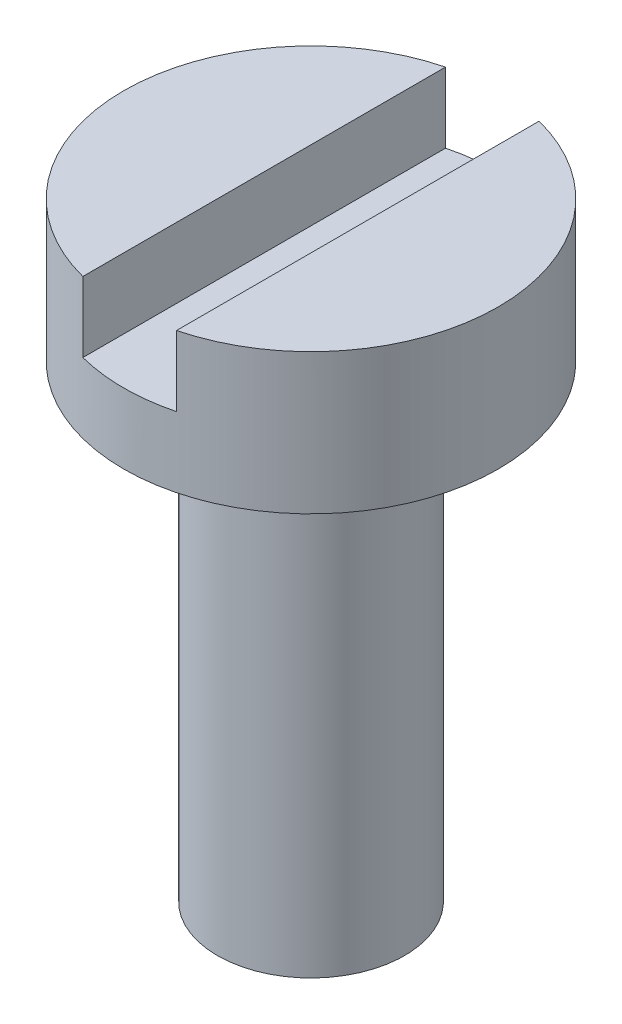
ISO-10303-21;
HEADER;
FILE_DESCRIPTION(('STEP AP214'),'2;1');
FILE_NAME('part.step','',(''),(''),'','','');
FILE_SCHEMA(('AUTOMOTIVE_DESIGN { 1 0 10303 214 1 1 1 1 }'));
ENDSEC;
DATA;
#1=APPLICATION_CONTEXT('core data for automotive mechanical design processes');
#2=APPLICATION_PROTOCOL_DEFINITION('international standard','automotive_design',2000,#1);
#3=PRODUCT_CONTEXT('',#1,'mechanical');
#4=PRODUCT('Part','Part','',(#3));
#5=PRODUCT_RELATED_PRODUCT_CATEGORY('part','',(#4));
#6=PRODUCT_DEFINITION_FORMATION('','',#4);
#7=PRODUCT_DEFINITION_CONTEXT('part definition',#1,'design');
#8=PRODUCT_DEFINITION('design','',#6,#7);
#9=PRODUCT_DEFINITION_SHAPE('','',#8);
#10=(LENGTH_UNIT() NAMED_UNIT(*) SI_UNIT(.MILLI.,.METRE.));
#11=(NAMED_UNIT(*) PLANE_ANGLE_UNIT() SI_UNIT($,.RADIAN.));
#12=(NAMED_UNIT(*) SI_UNIT($,.STERADIAN.) SOLID_ANGLE_UNIT());
#13=UNCERTAINTY_MEASURE_WITH_UNIT(LENGTH_MEASURE(1.E-05),#10,'distance_accuracy_value','');
#14=(GEOMETRIC_REPRESENTATION_CONTEXT(3) GLOBAL_UNCERTAINTY_ASSIGNED_CONTEXT((#13)) GLOBAL_UNIT_ASSIGNED_CONTEXT((#10,
#11,#12)) REPRESENTATION_CONTEXT('',''));
#15=CARTESIAN_POINT('',(0.,0.,0.));
#16=DIRECTION('',(0.,0.,1.));
#17=DIRECTION('',(1.,0.,0.));
#18=AXIS2_PLACEMENT_3D('',#15,#16,#17);
#19=CARTESIAN_POINT('',(0.,0.,0.));
#20=DIRECTION('',(0.,1.,0.));
#21=DIRECTION('',(0.,0.,1.));
#22=AXIS2_PLACEMENT_3D('',#19,#20,#21);
#23=PLANE('',#22);
#24=CARTESIAN_POINT('',(0.,0.,0.));
#25=DIRECTION('',(0.,1.,0.));
#26=DIRECTION('',(0.,0.,1.));
#27=AXIS2_PLACEMENT_3D('',#24,#25,#26);
#28=CIRCLE('',#27,4.);
#29=CARTESIAN_POINT('',(0.,0.,4.));
#30=VERTEX_POINT('',#29);
#31=EDGE_CURVE('E93',#30,#30,#28,.T.);
#32=ORIENTED_EDGE('',*,*,#31,.F.);
#33=EDGE_LOOP('',(#32));
#34=FACE_BOUND('',#33,.T.);
#35=CARTESIAN_POINT('',(0.,0.,0.));
#36=DIRECTION('',(0.,1.,0.));
#37=DIRECTION('',(0.,0.,1.));
#38=AXIS2_PLACEMENT_3D('',#35,#36,#37);
#39=CIRCLE('',#38,2.);
#40=CARTESIAN_POINT('',(0.,0.,2.));
#41=VERTEX_POINT('',#40);
#42=EDGE_CURVE('E11',#41,#41,#39,.F.);
#43=ORIENTED_EDGE('',*,*,#42,.F.);
#44=EDGE_LOOP('',(#43));
#45=FACE_BOUND('',#44,.T.);
#46=ADVANCED_FACE('F32',(#34,#45),#23,.F.);
#47=CARTESIAN_POINT('',(0.,3.,0.));
#48=DIRECTION('',(0.,1.,0.));
#49=DIRECTION('',(0.,0.,1.));
#50=AXIS2_PLACEMENT_3D('',#47,#48,#49);
#51=PLANE('',#50);
#52=DIRECTION('',(0.,0.,-1.));
#53=VECTOR('',#52,1.);
#54=CARTESIAN_POINT('',(1.,3.,0.));
#55=LINE('',#54,#53);
#56=CARTESIAN_POINT('',(1.,3.,3.87298334620742));
#57=VERTEX_POINT('',#56);
#58=CARTESIAN_POINT('',(1.,3.,-3.87298334620742));
#59=VERTEX_POINT('',#58);
#60=EDGE_CURVE('E80',#57,#59,#55,.T.);
#61=ORIENTED_EDGE('',*,*,#60,.F.);
#62=CARTESIAN_POINT('',(0.,3.,0.));
#63=DIRECTION('',(0.,1.,0.));
#64=DIRECTION('',(0.,0.,1.));
#65=AXIS2_PLACEMENT_3D('',#62,#63,#64);
#66=CIRCLE('',#65,4.);
#67=EDGE_CURVE('E81',#57,#59,#66,.T.);
#68=ORIENTED_EDGE('',*,*,#67,.T.);
#69=EDGE_LOOP('',(#61,#68));
#70=FACE_BOUND('',#69,.T.);
#71=ADVANCED_FACE('F113',(#70),#51,.T.);
#72=CARTESIAN_POINT('',(0.,3.,0.));
#73=DIRECTION('',(0.,-1.,0.));
#74=DIRECTION('',(0.,0.,-1.));
#75=AXIS2_PLACEMENT_3D('',#72,#73,#74);
#76=CYLINDRICAL_SURFACE('',#75,4.);
#77=CARTESIAN_POINT('',(0.,1.5,0.));
#78=DIRECTION('',(0.,1.,0.));
#79=DIRECTION('',(0.,0.,1.));
#80=AXIS2_PLACEMENT_3D('',#77,#78,#79);
#81=CIRCLE('',#80,4.);
#82=CARTESIAN_POINT('',(1.,1.5,-3.87298334620742));
#83=VERTEX_POINT('',#82);
#84=CARTESIAN_POINT('',(-1.,1.5,-3.87298334620742));
#85=VERTEX_POINT('',#84);
#86=EDGE_CURVE('E40',#83,#85,#81,.T.);
#87=ORIENTED_EDGE('',*,*,#86,.F.);
#88=DIRECTION('',(0.,-1.,0.));
#89=VECTOR('',#88,1.);
#90=CARTESIAN_POINT('',(1.,3.,-3.87298334620742));
#91=LINE('',#90,#89);
#92=EDGE_CURVE('E55',#83,#59,#91,.F.);
#93=ORIENTED_EDGE('',*,*,#92,.T.);
#94=ORIENTED_EDGE('',*,*,#67,.F.);
#95=DIRECTION('',(0.,-1.,0.));
#96=VECTOR('',#95,1.);
#97=CARTESIAN_POINT('',(1.,3.,3.87298334620742));
#98=LINE('',#97,#96);
#99=CARTESIAN_POINT('',(1.,1.5,3.87298334620742));
#100=VERTEX_POINT('',#99);
#101=EDGE_CURVE('E97',#57,#100,#98,.T.);
#102=ORIENTED_EDGE('',*,*,#101,.T.);
#103=CARTESIAN_POINT('',(-1.,1.5,3.87298334620742));
#104=VERTEX_POINT('',#103);
#105=EDGE_CURVE('E89',#104,#100,#81,.T.);
#106=ORIENTED_EDGE('',*,*,#105,.F.);
#107=DIRECTION('',(0.,-1.,0.));
#108=VECTOR('',#107,1.);
#109=CARTESIAN_POINT('',(-1.,3.,3.87298334620742));
#110=LINE('',#109,#108);
#111=CARTESIAN_POINT('',(-1.,3.,3.87298334620742));
#112=VERTEX_POINT('',#111);
#113=EDGE_CURVE('E75',#104,#112,#110,.F.);
#114=ORIENTED_EDGE('',*,*,#113,.T.);
#115=CARTESIAN_POINT('',(-1.,3.,-3.87298334620742));
#116=VERTEX_POINT('',#115);
#117=EDGE_CURVE('E87',#116,#112,#66,.T.);
#118=ORIENTED_EDGE('',*,*,#117,.F.);
#119=DIRECTION('',(0.,-1.,0.));
#120=VECTOR('',#119,1.);
#121=CARTESIAN_POINT('',(-1.,3.,-3.87298334620742));
#122=LINE('',#121,#120);
#123=EDGE_CURVE('E47',#116,#85,#122,.T.);
#124=ORIENTED_EDGE('',*,*,#123,.T.);
#125=EDGE_LOOP('',(#87,#93,#94,#102,#106,#114,#118,#124));
#126=FACE_BOUND('',#125,.T.);
#127=ORIENTED_EDGE('',*,*,#31,.T.);
#128=EDGE_LOOP('',(#127));
#129=FACE_BOUND('',#128,.T.);
#130=ADVANCED_FACE('F34',(#126,#129),#76,.T.);
#131=DIRECTION('',(0.,0.,1.));
#132=VECTOR('',#131,1.);
#133=CARTESIAN_POINT('',(-1.,3.,0.));
#134=LINE('',#133,#132);
#135=EDGE_CURVE('E72',#116,#112,#134,.T.);
#136=ORIENTED_EDGE('',*,*,#135,.F.);
#137=ORIENTED_EDGE('',*,*,#117,.T.);
#138=EDGE_LOOP('',(#136,#137));
#139=FACE_BOUND('',#138,.T.);
#140=ADVANCED_FACE('F92',(#139),#51,.T.);
#141=CARTESIAN_POINT('',(-1.,1.5,-5.0783360345759));
#142=DIRECTION('',(0.,1.,0.));
#143=DIRECTION('',(0.,0.,1.));
#144=AXIS2_PLACEMENT_3D('',#141,#142,#143);
#145=PLANE('',#144);
#146=ORIENTED_EDGE('',*,*,#86,.T.);
#147=DIRECTION('',(0.,0.,1.));
#148=VECTOR('',#147,1.);
#149=CARTESIAN_POINT('',(-1.,1.5,-5.0783360345759));
#150=LINE('',#149,#148);
#151=EDGE_CURVE('E103',#85,#104,#150,.T.);
#152=ORIENTED_EDGE('',*,*,#151,.T.);
#153=ORIENTED_EDGE('',*,*,#105,.T.);
#154=DIRECTION('',(0.,0.,-1.));
#155=VECTOR('',#154,1.);
#156=CARTESIAN_POINT('',(1.,1.5,4.40122456329912));
#157=LINE('',#156,#155);
#158=EDGE_CURVE('E90',#100,#83,#157,.T.);
#159=ORIENTED_EDGE('',*,*,#158,.T.);
#160=EDGE_LOOP('',(#146,#152,#153,#159));
#161=FACE_BOUND('',#160,.T.);
#162=ADVANCED_FACE('F102',(#161),#145,.T.);
#163=CARTESIAN_POINT('',(1.,1.5,4.40122456329912));
#164=DIRECTION('',(1.,0.,0.));
#165=DIRECTION('',(0.,0.,-1.));
#166=AXIS2_PLACEMENT_3D('',#163,#164,#165);
#167=PLANE('',#166);
#168=ORIENTED_EDGE('',*,*,#60,.T.);
#169=ORIENTED_EDGE('',*,*,#92,.F.);
#170=ORIENTED_EDGE('',*,*,#158,.F.);
#171=ORIENTED_EDGE('',*,*,#101,.F.);
#172=EDGE_LOOP('',(#168,#169,#170,#171));
#173=FACE_BOUND('',#172,.T.);
#174=ADVANCED_FACE('F111',(#173),#167,.F.);
#175=CARTESIAN_POINT('',(-1.,1.5,-5.0783360345759));
#176=DIRECTION('',(-1.,0.,0.));
#177=DIRECTION('',(0.,0.,1.));
#178=AXIS2_PLACEMENT_3D('',#175,#176,#177);
#179=PLANE('',#178);
#180=ORIENTED_EDGE('',*,*,#135,.T.);
#181=ORIENTED_EDGE('',*,*,#113,.F.);
#182=ORIENTED_EDGE('',*,*,#151,.F.);
#183=ORIENTED_EDGE('',*,*,#123,.F.);
#184=EDGE_LOOP('',(#180,#181,#182,#183));
#185=FACE_BOUND('',#184,.T.);
#186=ADVANCED_FACE('F74',(#185),#179,.F.);
#187=CARTESIAN_POINT('',(0.,-10.,0.));
#188=DIRECTION('',(0.,1.,0.));
#189=DIRECTION('',(0.,0.,1.));
#190=AXIS2_PLACEMENT_3D('',#187,#188,#189);
#191=CYLINDRICAL_SURFACE('',#190,2.);
#192=CARTESIAN_POINT('',(0.,-10.,0.));
#193=DIRECTION('',(0.,-1.,0.));
#194=DIRECTION('',(0.,0.,-1.));
#195=AXIS2_PLACEMENT_3D('',#192,#193,#194);
#196=CIRCLE('',#195,2.);
#197=CARTESIAN_POINT('',(0.,-10.,-2.));
#198=VERTEX_POINT('',#197);
#199=EDGE_CURVE('E104',#198,#198,#196,.T.);
#200=ORIENTED_EDGE('',*,*,#199,.F.);
#201=EDGE_LOOP('',(#200));
#202=FACE_BOUND('',#201,.T.);
#203=ORIENTED_EDGE('',*,*,#42,.T.);
#204=EDGE_LOOP('',(#203));
#205=FACE_BOUND('',#204,.T.);
#206=ADVANCED_FACE('F131',(#202,#205),#191,.T.);
#207=CARTESIAN_POINT('',(0.,-10.,0.));
#208=DIRECTION('',(0.,-1.,0.));
#209=DIRECTION('',(0.,0.,-1.));
#210=AXIS2_PLACEMENT_3D('',#207,#208,#209);
#211=PLANE('',#210);
#212=ORIENTED_EDGE('',*,*,#199,.T.);
#213=EDGE_LOOP('',(#212));
#214=FACE_BOUND('',#213,.T.);
#215=ADVANCED_FACE('F138',(#214),#211,.T.);
#216=CLOSED_SHELL('',(#46,#71,#130,#140,#162,#174,#186,#206,#215));
#217=MANIFOLD_SOLID_BREP('B2',#216);
#218=ADVANCED_BREP_SHAPE_REPRESENTATION('',(#18,#217),#14);
#219=SHAPE_DEFINITION_REPRESENTATION(#9,#218);
ENDSEC;
END-ISO-10303-21;
